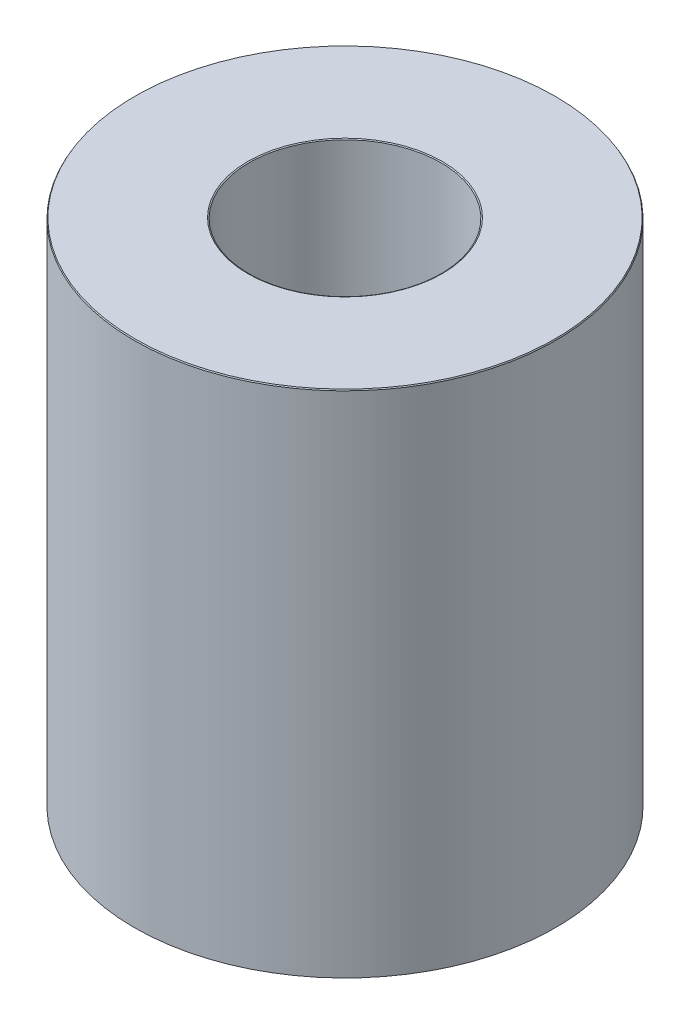
ISO-10303-21;
HEADER;
FILE_DESCRIPTION(('STEP AP214'),'2;1');
FILE_NAME('part.step','',(''),(''),'','','');
FILE_SCHEMA(('AUTOMOTIVE_DESIGN { 1 0 10303 214 1 1 1 1 }'));
ENDSEC;
DATA;
#1=APPLICATION_CONTEXT('core data for automotive mechanical design processes');
#2=APPLICATION_PROTOCOL_DEFINITION('international standard','automotive_design',2000,#1);
#3=PRODUCT_CONTEXT('',#1,'mechanical');
#4=PRODUCT('Part','Part','',(#3));
#5=PRODUCT_RELATED_PRODUCT_CATEGORY('part','',(#4));
#6=PRODUCT_DEFINITION_FORMATION('','',#4);
#7=PRODUCT_DEFINITION_CONTEXT('part definition',#1,'design');
#8=PRODUCT_DEFINITION('design','',#6,#7);
#9=PRODUCT_DEFINITION_SHAPE('','',#8);
#10=(LENGTH_UNIT() NAMED_UNIT(*) SI_UNIT(.MILLI.,.METRE.));
#11=(NAMED_UNIT(*) PLANE_ANGLE_UNIT() SI_UNIT($,.RADIAN.));
#12=(NAMED_UNIT(*) SI_UNIT($,.STERADIAN.) SOLID_ANGLE_UNIT());
#13=UNCERTAINTY_MEASURE_WITH_UNIT(LENGTH_MEASURE(1.E-05),#10,'distance_accuracy_value','');
#14=(GEOMETRIC_REPRESENTATION_CONTEXT(3) GLOBAL_UNCERTAINTY_ASSIGNED_CONTEXT((#13)) GLOBAL_UNIT_ASSIGNED_CONTEXT((#10,
#11,#12)) REPRESENTATION_CONTEXT('',''));
#15=CARTESIAN_POINT('',(0.,0.,0.));
#16=DIRECTION('',(0.,0.,1.));
#17=DIRECTION('',(1.,0.,0.));
#18=AXIS2_PLACEMENT_3D('',#15,#16,#17);
#19=CARTESIAN_POINT('',(0.,108.928816675708,0.));
#20=DIRECTION('',(0.,-1.,0.));
#21=DIRECTION('',(0.,0.,-1.));
#22=AXIS2_PLACEMENT_3D('',#19,#20,#21);
#23=CYLINDRICAL_SURFACE('',#22,45.);
#24=CARTESIAN_POINT('',(0.,0.134649745348214,0.));
#25=DIRECTION('',(0.,1.,0.));
#26=DIRECTION('',(0.,0.,1.));
#27=AXIS2_PLACEMENT_3D('',#24,#25,#26);
#28=CIRCLE('',#27,45.);
#29=CARTESIAN_POINT('',(0.,0.134649745348214,45.));
#30=VERTEX_POINT('',#29);
#31=EDGE_CURVE('E10',#30,#30,#28,.T.);
#32=ORIENTED_EDGE('',*,*,#31,.T.);
#33=EDGE_LOOP('',(#32));
#34=FACE_BOUND('',#33,.T.);
#35=CARTESIAN_POINT('',(0.,108.695596475539,0.));
#36=DIRECTION('',(0.,1.,0.));
#37=DIRECTION('',(0.,0.,1.));
#38=AXIS2_PLACEMENT_3D('',#35,#36,#37);
#39=CIRCLE('',#38,45.);
#40=CARTESIAN_POINT('',(0.,108.695596475539,45.));
#41=VERTEX_POINT('',#40);
#42=EDGE_CURVE('E50',#41,#41,#39,.F.);
#43=ORIENTED_EDGE('',*,*,#42,.T.);
#44=EDGE_LOOP('',(#43));
#45=FACE_BOUND('',#44,.T.);
#46=ADVANCED_FACE('F39',(#34,#45),#23,.T.);
#47=CARTESIAN_POINT('',(0.,108.928816675708,0.));
#48=DIRECTION('',(0.,1.,0.));
#49=DIRECTION('',(0.,0.,1.));
#50=AXIS2_PLACEMENT_3D('',#47,#48,#49);
#51=PLANE('',#50);
#52=CARTESIAN_POINT('',(0.,108.928816675708,0.));
#53=DIRECTION('',(0.,1.,0.));
#54=DIRECTION('',(0.,0.,1.));
#55=AXIS2_PLACEMENT_3D('',#52,#53,#54);
#56=CIRCLE('',#55,20.7586754548851);
#57=CARTESIAN_POINT('',(0.,108.928816675708,20.7586754548851));
#58=VERTEX_POINT('',#57);
#59=EDGE_CURVE('E58',#58,#58,#56,.F.);
#60=ORIENTED_EDGE('',*,*,#59,.T.);
#61=EDGE_LOOP('',(#60));
#62=FACE_BOUND('',#61,.T.);
#63=CARTESIAN_POINT('',(0.,108.928816675708,0.));
#64=DIRECTION('',(0.,1.,0.));
#65=DIRECTION('',(0.,0.,1.));
#66=AXIS2_PLACEMENT_3D('',#63,#64,#65);
#67=CIRCLE('',#66,44.8653502546518);
#68=CARTESIAN_POINT('',(0.,108.928816675708,44.8653502546518));
#69=VERTEX_POINT('',#68);
#70=EDGE_CURVE('E61',#69,#69,#67,.T.);
#71=ORIENTED_EDGE('',*,*,#70,.T.);
#72=EDGE_LOOP('',(#71));
#73=FACE_BOUND('',#72,.T.);
#74=ADVANCED_FACE('F88',(#62,#73),#51,.T.);
#75=CARTESIAN_POINT('',(0.,0.,0.));
#76=DIRECTION('',(0.,1.,0.));
#77=DIRECTION('',(0.,0.,1.));
#78=AXIS2_PLACEMENT_3D('',#75,#76,#77);
#79=PLANE('',#78);
#80=CARTESIAN_POINT('',(0.,0.,0.));
#81=DIRECTION('',(0.,1.,0.));
#82=DIRECTION('',(0.,0.,1.));
#83=AXIS2_PLACEMENT_3D('',#80,#81,#82);
#84=CIRCLE('',#83,20.6601050000641);
#85=CARTESIAN_POINT('',(0.,0.,20.6601050000641));
#86=VERTEX_POINT('',#85);
#87=EDGE_CURVE('E51',#86,#86,#84,.T.);
#88=ORIENTED_EDGE('',*,*,#87,.T.);
#89=EDGE_LOOP('',(#88));
#90=FACE_BOUND('',#89,.T.);
#91=CARTESIAN_POINT('',(0.,0.,0.));
#92=DIRECTION('',(0.,1.,0.));
#93=DIRECTION('',(0.,0.,1.));
#94=AXIS2_PLACEMENT_3D('',#91,#92,#93);
#95=CIRCLE('',#94,44.7667797998307);
#96=CARTESIAN_POINT('',(0.,0.,44.7667797998307));
#97=VERTEX_POINT('',#96);
#98=EDGE_CURVE('E54',#97,#97,#95,.F.);
#99=ORIENTED_EDGE('',*,*,#98,.T.);
#100=EDGE_LOOP('',(#99));
#101=FACE_BOUND('',#100,.T.);
#102=ADVANCED_FACE('F83',(#90,#101),#79,.F.);
#103=CARTESIAN_POINT('',(0.,108.928816675708,0.));
#104=DIRECTION('',(0.,-1.,0.));
#105=DIRECTION('',(0.,0.,-1.));
#106=AXIS2_PLACEMENT_3D('',#103,#104,#105);
#107=CYLINDRICAL_SURFACE('',#106,20.5254552547158);
#108=CARTESIAN_POINT('',(0.,108.79416693036,0.));
#109=DIRECTION('',(0.,1.,0.));
#110=DIRECTION('',(0.,0.,1.));
#111=AXIS2_PLACEMENT_3D('',#108,#109,#110);
#112=CIRCLE('',#111,20.5254552547158);
#113=CARTESIAN_POINT('',(0.,108.79416693036,20.5254552547158));
#114=VERTEX_POINT('',#113);
#115=EDGE_CURVE('E67',#114,#114,#112,.T.);
#116=ORIENTED_EDGE('',*,*,#115,.T.);
#117=EDGE_LOOP('',(#116));
#118=FACE_BOUND('',#117,.T.);
#119=CARTESIAN_POINT('',(0.,0.23322020016936,0.));
#120=DIRECTION('',(0.,1.,0.));
#121=DIRECTION('',(0.,0.,1.));
#122=AXIS2_PLACEMENT_3D('',#119,#120,#121);
#123=CIRCLE('',#122,20.5254552547158);
#124=CARTESIAN_POINT('',(0.,0.23322020016936,20.5254552547158));
#125=VERTEX_POINT('',#124);
#126=EDGE_CURVE('E69',#125,#125,#123,.F.);
#127=ORIENTED_EDGE('',*,*,#126,.T.);
#128=EDGE_LOOP('',(#127));
#129=FACE_BOUND('',#128,.T.);
#130=ADVANCED_FACE('F71',(#118,#129),#107,.F.);
#131=CARTESIAN_POINT('',(0.,108.79416693036,0.));
#132=DIRECTION('',(0.,1.,0.));
#133=DIRECTION('',(0.,0.,1.));
#134=AXIS2_PLACEMENT_3D('',#131,#132,#133);
#135=CONICAL_SURFACE('',#134,20.5254552547158,1.04719755119661);
#136=ORIENTED_EDGE('',*,*,#59,.F.);
#137=EDGE_LOOP('',(#136));
#138=FACE_BOUND('',#137,.T.);
#139=ORIENTED_EDGE('',*,*,#115,.F.);
#140=EDGE_LOOP('',(#139));
#141=FACE_BOUND('',#140,.T.);
#142=ADVANCED_FACE('F77',(#138,#141),#135,.F.);
#143=CARTESIAN_POINT('',(0.,0.,0.));
#144=DIRECTION('',(0.,-1.,0.));
#145=DIRECTION('',(0.,0.,-1.));
#146=AXIS2_PLACEMENT_3D('',#143,#144,#145);
#147=CONICAL_SURFACE('',#146,20.6601050000641,0.5235987755983);
#148=ORIENTED_EDGE('',*,*,#126,.F.);
#149=EDGE_LOOP('',(#148));
#150=FACE_BOUND('',#149,.T.);
#151=ORIENTED_EDGE('',*,*,#87,.F.);
#152=EDGE_LOOP('',(#151));
#153=FACE_BOUND('',#152,.T.);
#154=ADVANCED_FACE('F73',(#150,#153),#147,.F.);
#155=CARTESIAN_POINT('',(0.,0.134649745348214,0.));
#156=DIRECTION('',(0.,1.,0.));
#157=DIRECTION('',(0.,0.,1.));
#158=AXIS2_PLACEMENT_3D('',#155,#156,#157);
#159=CONICAL_SURFACE('',#158,45.,1.04719755119658);
#160=ORIENTED_EDGE('',*,*,#98,.F.);
#161=EDGE_LOOP('',(#160));
#162=FACE_BOUND('',#161,.T.);
#163=ORIENTED_EDGE('',*,*,#31,.F.);
#164=EDGE_LOOP('',(#163));
#165=FACE_BOUND('',#164,.T.);
#166=ADVANCED_FACE('F76',(#162,#165),#159,.T.);
#167=CARTESIAN_POINT('',(0.,108.928816675708,0.));
#168=DIRECTION('',(0.,-1.,0.));
#169=DIRECTION('',(0.,0.,-1.));
#170=AXIS2_PLACEMENT_3D('',#167,#168,#169);
#171=CONICAL_SURFACE('',#170,44.8653502546518,0.523598775598317);
#172=ORIENTED_EDGE('',*,*,#42,.F.);
#173=EDGE_LOOP('',(#172));
#174=FACE_BOUND('',#173,.T.);
#175=ORIENTED_EDGE('',*,*,#70,.F.);
#176=EDGE_LOOP('',(#175));
#177=FACE_BOUND('',#176,.T.);
#178=ADVANCED_FACE('F45',(#174,#177),#171,.T.);
#179=CLOSED_SHELL('',(#46,#74,#102,#130,#142,#154,#166,#178));
#180=MANIFOLD_SOLID_BREP('B2',#179);
#181=ADVANCED_BREP_SHAPE_REPRESENTATION('',(#18,#180),#14);
#182=SHAPE_DEFINITION_REPRESENTATION(#9,#181);
ENDSEC;
END-ISO-10303-21;
